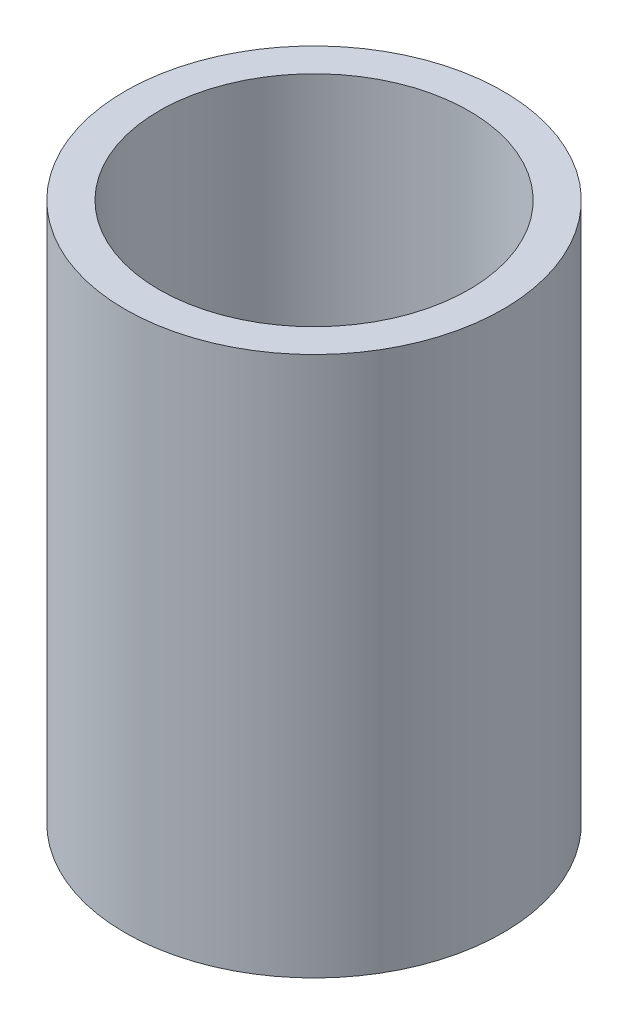
ISO-10303-21;
HEADER;
FILE_DESCRIPTION(('STEP AP214'),'2;1');
FILE_NAME('part.step','',(''),(''),'','','');
FILE_SCHEMA(('AUTOMOTIVE_DESIGN { 1 0 10303 214 1 1 1 1 }'));
ENDSEC;
DATA;
#1=APPLICATION_CONTEXT('core data for automotive mechanical design processes');
#2=APPLICATION_PROTOCOL_DEFINITION('international standard','automotive_design',2000,#1);
#3=PRODUCT_CONTEXT('',#1,'mechanical');
#4=PRODUCT('Part','Part','',(#3));
#5=PRODUCT_RELATED_PRODUCT_CATEGORY('part','',(#4));
#6=PRODUCT_DEFINITION_FORMATION('','',#4);
#7=PRODUCT_DEFINITION_CONTEXT('part definition',#1,'design');
#8=PRODUCT_DEFINITION('design','',#6,#7);
#9=PRODUCT_DEFINITION_SHAPE('','',#8);
#10=(LENGTH_UNIT() NAMED_UNIT(*) SI_UNIT(.MILLI.,.METRE.));
#11=(NAMED_UNIT(*) PLANE_ANGLE_UNIT() SI_UNIT($,.RADIAN.));
#12=(NAMED_UNIT(*) SI_UNIT($,.STERADIAN.) SOLID_ANGLE_UNIT());
#13=UNCERTAINTY_MEASURE_WITH_UNIT(LENGTH_MEASURE(1.E-05),#10,'distance_accuracy_value','');
#14=(GEOMETRIC_REPRESENTATION_CONTEXT(3) GLOBAL_UNCERTAINTY_ASSIGNED_CONTEXT((#13)) GLOBAL_UNIT_ASSIGNED_CONTEXT((#10,
#11,#12)) REPRESENTATION_CONTEXT('',''));
#15=CARTESIAN_POINT('',(0.,0.,0.));
#16=DIRECTION('',(0.,0.,1.));
#17=DIRECTION('',(1.,0.,0.));
#18=AXIS2_PLACEMENT_3D('',#15,#16,#17);
#19=CARTESIAN_POINT('',(0.,171.422149728663,0.));
#20=DIRECTION('',(0.,-1.,0.));
#21=DIRECTION('',(0.,0.,-1.));
#22=AXIS2_PLACEMENT_3D('',#19,#20,#21);
#23=CYLINDRICAL_SURFACE('',#22,60.);
#24=CARTESIAN_POINT('',(0.,171.422149728663,0.));
#25=DIRECTION('',(0.,1.,0.));
#26=DIRECTION('',(0.,0.,1.));
#27=AXIS2_PLACEMENT_3D('',#24,#25,#26);
#28=CIRCLE('',#27,60.);
#29=CARTESIAN_POINT('',(0.,171.422149728663,60.));
#30=VERTEX_POINT('',#29);
#31=EDGE_CURVE('E10',#30,#30,#28,.T.);
#32=ORIENTED_EDGE('',*,*,#31,.F.);
#33=EDGE_LOOP('',(#32));
#34=FACE_BOUND('',#33,.T.);
#35=CARTESIAN_POINT('',(0.,0.,0.));
#36=DIRECTION('',(0.,1.,0.));
#37=DIRECTION('',(0.,0.,1.));
#38=AXIS2_PLACEMENT_3D('',#35,#36,#37);
#39=CIRCLE('',#38,60.);
#40=CARTESIAN_POINT('',(0.,0.,60.));
#41=VERTEX_POINT('',#40);
#42=EDGE_CURVE('E37',#41,#41,#39,.T.);
#43=ORIENTED_EDGE('',*,*,#42,.T.);
#44=EDGE_LOOP('',(#43));
#45=FACE_BOUND('',#44,.T.);
#46=ADVANCED_FACE('F40',(#34,#45),#23,.T.);
#47=CARTESIAN_POINT('',(0.,171.422149728663,0.));
#48=DIRECTION('',(0.,1.,0.));
#49=DIRECTION('',(0.,0.,1.));
#50=AXIS2_PLACEMENT_3D('',#47,#48,#49);
#51=PLANE('',#50);
#52=CARTESIAN_POINT('',(0.,171.422149728663,0.));
#53=DIRECTION('',(0.,1.,0.));
#54=DIRECTION('',(0.,0.,1.));
#55=AXIS2_PLACEMENT_3D('',#52,#53,#54);
#56=CIRCLE('',#55,49.1869528889276);
#57=CARTESIAN_POINT('',(0.,171.422149728663,49.1869528889276));
#58=VERTEX_POINT('',#57);
#59=EDGE_CURVE('E50',#58,#58,#56,.T.);
#60=ORIENTED_EDGE('',*,*,#59,.F.);
#61=EDGE_LOOP('',(#60));
#62=FACE_BOUND('',#61,.T.);
#63=ORIENTED_EDGE('',*,*,#31,.T.);
#64=EDGE_LOOP('',(#63));
#65=FACE_BOUND('',#64,.T.);
#66=ADVANCED_FACE('F59',(#62,#65),#51,.T.);
#67=CARTESIAN_POINT('',(0.,0.,0.));
#68=DIRECTION('',(0.,1.,0.));
#69=DIRECTION('',(0.,0.,1.));
#70=AXIS2_PLACEMENT_3D('',#67,#68,#69);
#71=PLANE('',#70);
#72=CARTESIAN_POINT('',(0.,0.,0.));
#73=DIRECTION('',(0.,1.,0.));
#74=DIRECTION('',(0.,0.,1.));
#75=AXIS2_PLACEMENT_3D('',#72,#73,#74);
#76=CIRCLE('',#75,49.1869528889276);
#77=CARTESIAN_POINT('',(0.,0.,49.1869528889276));
#78=VERTEX_POINT('',#77);
#79=EDGE_CURVE('E47',#78,#78,#76,.T.);
#80=ORIENTED_EDGE('',*,*,#79,.T.);
#81=EDGE_LOOP('',(#80));
#82=FACE_BOUND('',#81,.T.);
#83=ORIENTED_EDGE('',*,*,#42,.F.);
#84=EDGE_LOOP('',(#83));
#85=FACE_BOUND('',#84,.T.);
#86=ADVANCED_FACE('F58',(#82,#85),#71,.F.);
#87=CARTESIAN_POINT('',(0.,171.422149728663,0.));
#88=DIRECTION('',(0.,-1.,0.));
#89=DIRECTION('',(0.,0.,-1.));
#90=AXIS2_PLACEMENT_3D('',#87,#88,#89);
#91=CYLINDRICAL_SURFACE('',#90,49.1869528889276);
#92=ORIENTED_EDGE('',*,*,#59,.T.);
#93=EDGE_LOOP('',(#92));
#94=FACE_BOUND('',#93,.T.);
#95=ORIENTED_EDGE('',*,*,#79,.F.);
#96=EDGE_LOOP('',(#95));
#97=FACE_BOUND('',#96,.T.);
#98=ADVANCED_FACE('F54',(#94,#97),#91,.F.);
#99=CLOSED_SHELL('',(#46,#66,#86,#98));
#100=MANIFOLD_SOLID_BREP('B2',#99);
#101=ADVANCED_BREP_SHAPE_REPRESENTATION('',(#18,#100),#14);
#102=SHAPE_DEFINITION_REPRESENTATION(#9,#101);
ENDSEC;
END-ISO-10303-21;
